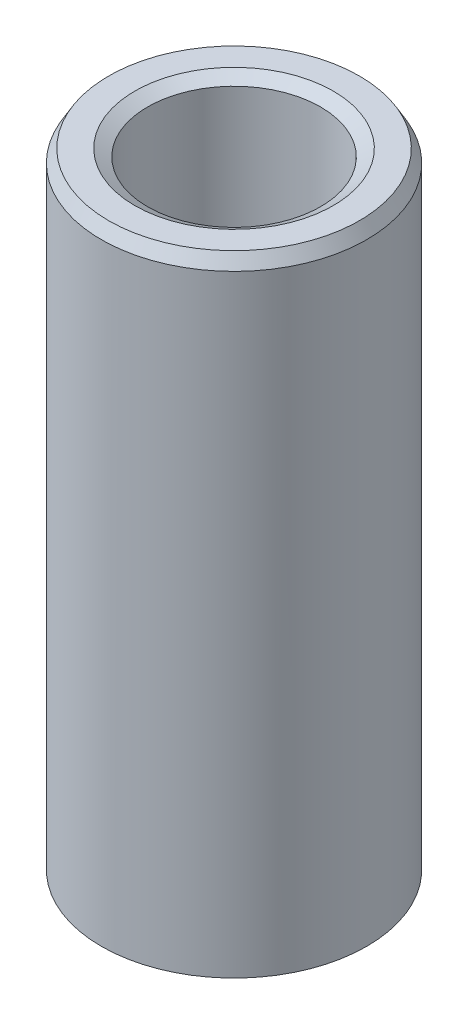
ISO-10303-21;
HEADER;
FILE_DESCRIPTION(('STEP AP214'),'2;1');
FILE_NAME('part.step','',(''),(''),'','','');
FILE_SCHEMA(('AUTOMOTIVE_DESIGN { 1 0 10303 214 1 1 1 1 }'));
ENDSEC;
DATA;
#1=APPLICATION_CONTEXT('core data for automotive mechanical design processes');
#2=APPLICATION_PROTOCOL_DEFINITION('international standard','automotive_design',2000,#1);
#3=PRODUCT_CONTEXT('',#1,'mechanical');
#4=PRODUCT('Part','Part','',(#3));
#5=PRODUCT_RELATED_PRODUCT_CATEGORY('part','',(#4));
#6=PRODUCT_DEFINITION_FORMATION('','',#4);
#7=PRODUCT_DEFINITION_CONTEXT('part definition',#1,'design');
#8=PRODUCT_DEFINITION('design','',#6,#7);
#9=PRODUCT_DEFINITION_SHAPE('','',#8);
#10=(LENGTH_UNIT() NAMED_UNIT(*) SI_UNIT(.MILLI.,.METRE.));
#11=(NAMED_UNIT(*) PLANE_ANGLE_UNIT() SI_UNIT($,.RADIAN.));
#12=(NAMED_UNIT(*) SI_UNIT($,.STERADIAN.) SOLID_ANGLE_UNIT());
#13=UNCERTAINTY_MEASURE_WITH_UNIT(LENGTH_MEASURE(1.E-05),#10,'distance_accuracy_value','');
#14=(GEOMETRIC_REPRESENTATION_CONTEXT(3) GLOBAL_UNCERTAINTY_ASSIGNED_CONTEXT((#13)) GLOBAL_UNIT_ASSIGNED_CONTEXT((#10,
#11,#12)) REPRESENTATION_CONTEXT('',''));
#15=CARTESIAN_POINT('',(0.,0.,0.));
#16=DIRECTION('',(0.,0.,1.));
#17=DIRECTION('',(1.,0.,0.));
#18=AXIS2_PLACEMENT_3D('',#15,#16,#17);
#19=CARTESIAN_POINT('',(0.,71.4394837840587,0.));
#20=DIRECTION('',(0.,-1.,0.));
#21=DIRECTION('',(0.,0.,-1.));
#22=AXIS2_PLACEMENT_3D('',#19,#20,#21);
#23=CYLINDRICAL_SURFACE('',#22,15.);
#24=CARTESIAN_POINT('',(0.,0.831120561861132,0.));
#25=DIRECTION('',(0.,1.,0.));
#26=DIRECTION('',(0.,0.,1.));
#27=AXIS2_PLACEMENT_3D('',#24,#25,#26);
#28=CIRCLE('',#27,15.);
#29=CARTESIAN_POINT('',(0.,0.831120561861118,-15.));
#30=VERTEX_POINT('',#29);
#31=EDGE_CURVE('E10',#30,#30,#28,.T.);
#32=CARTESIAN_POINT('',(0.,69.9999407437002,0.));
#33=DIRECTION('',(0.,1.,0.));
#34=DIRECTION('',(0.,0.,1.));
#35=AXIS2_PLACEMENT_3D('',#32,#33,#34);
#36=CIRCLE('',#35,15.);
#37=CARTESIAN_POINT('',(0.,69.9999407437002,-15.));
#38=VERTEX_POINT('',#37);
#39=EDGE_CURVE('E50',#38,#38,#36,.F.);
#40=CARTESIAN_POINT('',(0.,0.831120561861118,-15.));
#41=CARTESIAN_POINT('',(0.,1.55162910542194,-15.));
#42=CARTESIAN_POINT('',(0.,2.27213764898277,-15.));
#43=CARTESIAN_POINT('',(0.,3.71315473610441,-15.));
#44=CARTESIAN_POINT('',(0.,4.43366327966524,-15.));
#45=CARTESIAN_POINT('',(0.,5.87468036678688,-15.));
#46=CARTESIAN_POINT('',(0.,6.59518891034771,-15.));
#47=CARTESIAN_POINT('',(0.,8.03620599746935,-15.));
#48=CARTESIAN_POINT('',(0.,8.75671454103018,-15.));
#49=CARTESIAN_POINT('',(0.,10.1977316281518,-15.));
#50=CARTESIAN_POINT('',(0.,10.9182401717126,-15.));
#51=CARTESIAN_POINT('',(0.,12.3592572588343,-15.));
#52=CARTESIAN_POINT('',(0.,13.0797658023951,-15.));
#53=CARTESIAN_POINT('',(0.,14.5207828895168,-15.));
#54=CARTESIAN_POINT('',(0.,15.2412914330776,-15.));
#55=CARTESIAN_POINT('',(0.,16.6823085201992,-15.));
#56=CARTESIAN_POINT('',(0.,17.4028170637601,-15.));
#57=CARTESIAN_POINT('',(0.,18.8438341508817,-15.));
#58=CARTESIAN_POINT('',(0.,19.5643426944425,-15.));
#59=CARTESIAN_POINT('',(0.,21.0053597815642,-15.));
#60=CARTESIAN_POINT('',(0.,21.725868325125,-15.));
#61=CARTESIAN_POINT('',(0.,23.1668854122466,-15.));
#62=CARTESIAN_POINT('',(0.,23.8873939558075,-15.));
#63=CARTESIAN_POINT('',(0.,25.3284110429291,-15.));
#64=CARTESIAN_POINT('',(0.,26.0489195864899,-15.));
#65=CARTESIAN_POINT('',(0.,27.4899366736116,-15.));
#66=CARTESIAN_POINT('',(0.,28.2104452171724,-15.));
#67=CARTESIAN_POINT('',(0.,29.6514623042941,-15.));
#68=CARTESIAN_POINT('',(0.,30.3719708478549,-15.));
#69=CARTESIAN_POINT('',(0.,31.8129879349765,-15.));
#70=CARTESIAN_POINT('',(0.,32.5334964785374,-15.));
#71=CARTESIAN_POINT('',(0.,33.974513565659,-15.));
#72=CARTESIAN_POINT('',(0.,34.6950221092198,-15.));
#73=CARTESIAN_POINT('',(0.,36.1360391963415,-15.));
#74=CARTESIAN_POINT('',(0.,36.8565477399023,-15.));
#75=CARTESIAN_POINT('',(0.,38.2975648270239,-15.));
#76=CARTESIAN_POINT('',(0.,39.0180733705848,-15.));
#77=CARTESIAN_POINT('',(0.,40.4590904577064,-15.));
#78=CARTESIAN_POINT('',(0.,41.1795990012672,-15.));
#79=CARTESIAN_POINT('',(0.,42.6206160883889,-15.));
#80=CARTESIAN_POINT('',(0.,43.3411246319497,-15.));
#81=CARTESIAN_POINT('',(0.,44.7821417190714,-15.));
#82=CARTESIAN_POINT('',(0.,45.5026502626322,-15.));
#83=CARTESIAN_POINT('',(0.,46.9436673497538,-15.));
#84=CARTESIAN_POINT('',(0.,47.6641758933147,-15.));
#85=CARTESIAN_POINT('',(0.,49.1051929804363,-15.));
#86=CARTESIAN_POINT('',(0.,49.8257015239971,-15.));
#87=CARTESIAN_POINT('',(0.,51.2667186111188,-15.));
#88=CARTESIAN_POINT('',(0.,51.9872271546796,-15.));
#89=CARTESIAN_POINT('',(0.,53.4282442418013,-15.));
#90=CARTESIAN_POINT('',(0.,54.1487527853621,-15.));
#91=CARTESIAN_POINT('',(0.,55.5897698724837,-15.));
#92=CARTESIAN_POINT('',(0.,56.3102784160445,-15.));
#93=CARTESIAN_POINT('',(0.,57.7512955031662,-15.));
#94=CARTESIAN_POINT('',(0.,58.471804046727,-15.));
#95=CARTESIAN_POINT('',(0.,59.9128211338487,-15.));
#96=CARTESIAN_POINT('',(0.,60.6333296774095,-15.));
#97=CARTESIAN_POINT('',(0.,62.0743467645311,-15.));
#98=CARTESIAN_POINT('',(0.,62.794855308092,-15.));
#99=CARTESIAN_POINT('',(0.,64.2358723952136,-15.));
#100=CARTESIAN_POINT('',(0.,64.9563809387744,-15.));
#101=CARTESIAN_POINT('',(0.,66.3973980258961,-15.));
#102=CARTESIAN_POINT('',(0.,67.1179065694569,-15.));
#103=CARTESIAN_POINT('',(0.,68.5589236565785,-15.));
#104=CARTESIAN_POINT('',(0.,69.2794322001394,-15.));
#105=CARTESIAN_POINT('',(0.,69.9999407437002,-15.));
#106=B_SPLINE_CURVE_WITH_KNOTS('',3,(#40,#41,#42,#43,#44,#45,#46,#47,#48,#49,#50,#51,#52,#53,
#54,#55,#56,#57,#58,#59,#60,#61,#62,#63,#64,#65,#66,#67,#68,#69,#70,#71,#72,#73,#74,#75,#76,#77,
#78,#79,#80,#81,#82,#83,#84,#85,#86,#87,#88,#89,#90,#91,#92,#93,#94,#95,#96,#97,#98,#99,#100,
#101,#102,#103,#104,#105),.UNSPECIFIED.,.F.,.F.,(4,2,2,2,2,2,2,2,2,2,2,2,2,2,2,2,2,2,2,2,2,2,2,
2,2,2,2,2,2,2,2,2,4),(0.,2.16152563068248,4.32305126136494,6.48457689204741,8.64610252272988,
10.8076281534124,12.9691537840948,15.1306794147773,17.2922050454598,19.4537306761422,
21.6152563068247,23.7767819375072,25.9383075681896,28.0998331988721,30.2613588295546,
32.4228844602371,34.5844100909195,36.745935721602,38.9074613522845,41.0689869829669,
43.2305126136494,45.3920382443319,47.5535638750144,49.7150895056968,51.8766151363793,
54.0381407670618,56.1996663977443,58.3611920284267,60.5227176591092,62.6842432897917,
64.8457689204741,67.0072945511566,69.1688201818391),.UNSPECIFIED.);
#107=EDGE_CURVE('BSEAM39',#30,#38,#106,.T.);
#108=ORIENTED_EDGE('',*,*,#31,.T.);
#109=ORIENTED_EDGE('',*,*,#39,.T.);
#110=ORIENTED_EDGE('',*,*,#107,.T.);
#111=ORIENTED_EDGE('',*,*,#107,.F.);
#112=EDGE_LOOP('',(#108,#110,#109,#111));
#113=FACE_BOUND('',#112,.T.);
#114=ADVANCED_FACE('F39',(#113),#23,.T.);
#115=CARTESIAN_POINT('',(0.,71.4394837840587,0.));
#116=DIRECTION('',(0.,1.,0.));
#117=DIRECTION('',(0.,0.,1.));
#118=AXIS2_PLACEMENT_3D('',#115,#116,#117);
#119=PLANE('',#118);
#120=CARTESIAN_POINT('',(0.,71.4394837840587,0.));
#121=DIRECTION('',(0.,1.,0.));
#122=DIRECTION('',(0.,0.,1.));
#123=AXIS2_PLACEMENT_3D('',#120,#121,#122);
#124=CIRCLE('',#123,11.2150899528839);
#125=CARTESIAN_POINT('',(0.,71.4394837840587,11.2150899528839));
#126=VERTEX_POINT('',#125);
#127=EDGE_CURVE('E58',#126,#126,#124,.F.);
#128=ORIENTED_EDGE('',*,*,#127,.T.);
#129=EDGE_LOOP('',(#128));
#130=FACE_BOUND('',#129,.T.);
#131=CARTESIAN_POINT('',(0.,71.4394837840587,0.));
#132=DIRECTION('',(0.,1.,0.));
#133=DIRECTION('',(0.,0.,1.));
#134=AXIS2_PLACEMENT_3D('',#131,#132,#133);
#135=CIRCLE('',#134,14.168879438139);
#136=CARTESIAN_POINT('',(0.,71.4394837840587,14.168879438139));
#137=VERTEX_POINT('',#136);
#138=EDGE_CURVE('E61',#137,#137,#135,.T.);
#139=ORIENTED_EDGE('',*,*,#138,.T.);
#140=EDGE_LOOP('',(#139));
#141=FACE_BOUND('',#140,.T.);
#142=ADVANCED_FACE('F88',(#130,#141),#119,.T.);
#143=CARTESIAN_POINT('',(0.,0.,0.));
#144=DIRECTION('',(0.,1.,0.));
#145=DIRECTION('',(0.,0.,1.));
#146=AXIS2_PLACEMENT_3D('',#143,#144,#145);
#147=PLANE('',#146);
#148=CARTESIAN_POINT('',(0.,0.,0.));
#149=DIRECTION('',(0.,1.,0.));
#150=DIRECTION('',(0.,0.,1.));
#151=AXIS2_PLACEMENT_3D('',#148,#149,#150);
#152=CIRCLE('',#151,10.6066674743864);
#153=CARTESIAN_POINT('',(0.,0.,10.6066674743864));
#154=VERTEX_POINT('',#153);
#155=EDGE_CURVE('E51',#154,#154,#152,.T.);
#156=ORIENTED_EDGE('',*,*,#155,.T.);
#157=EDGE_LOOP('',(#156));
#158=FACE_BOUND('',#157,.T.);
#159=CARTESIAN_POINT('',(0.,0.,0.));
#160=DIRECTION('',(0.,1.,0.));
#161=DIRECTION('',(0.,0.,1.));
#162=AXIS2_PLACEMENT_3D('',#159,#160,#161);
#163=CIRCLE('',#162,13.5604569596413);
#164=CARTESIAN_POINT('',(0.,0.,13.5604569596413));
#165=VERTEX_POINT('',#164);
#166=EDGE_CURVE('E54',#165,#165,#163,.F.);
#167=ORIENTED_EDGE('',*,*,#166,.T.);
#168=EDGE_LOOP('',(#167));
#169=FACE_BOUND('',#168,.T.);
#170=ADVANCED_FACE('F83',(#158,#169),#147,.F.);
#171=CARTESIAN_POINT('',(0.,71.4394837840587,0.));
#172=DIRECTION('',(0.,-1.,0.));
#173=DIRECTION('',(0.,0.,-1.));
#174=AXIS2_PLACEMENT_3D('',#171,#172,#173);
#175=CYLINDRICAL_SURFACE('',#174,9.77554691252529);
#176=CARTESIAN_POINT('',(0.,70.6083632221976,0.));
#177=DIRECTION('',(0.,1.,0.));
#178=DIRECTION('',(0.,0.,1.));
#179=AXIS2_PLACEMENT_3D('',#176,#177,#178);
#180=CIRCLE('',#179,9.77554691252529);
#181=CARTESIAN_POINT('',(0.,70.6083632221976,-9.77554691252529));
#182=VERTEX_POINT('',#181);
#183=EDGE_CURVE('E67',#182,#182,#180,.T.);
#184=CARTESIAN_POINT('',(0.,1.43954304035862,0.));
#185=DIRECTION('',(0.,1.,0.));
#186=DIRECTION('',(0.,0.,1.));
#187=AXIS2_PLACEMENT_3D('',#184,#185,#186);
#188=CIRCLE('',#187,9.77554691252529);
#189=CARTESIAN_POINT('',(0.,1.43954304035861,-9.77554691252529));
#190=VERTEX_POINT('',#189);
#191=EDGE_CURVE('E69',#190,#190,#188,.F.);
#192=CARTESIAN_POINT('',(0.,70.6083632221976,-9.77554691252529));
#193=CARTESIAN_POINT('',(0.,69.8878546786368,-9.77554691252529));
#194=CARTESIAN_POINT('',(0.,69.167346135076,-9.77554691252529));
#195=CARTESIAN_POINT('',(0.,67.7263290479543,-9.77554691252529));
#196=CARTESIAN_POINT('',(0.,67.0058205043935,-9.77554691252529));
#197=CARTESIAN_POINT('',(0.,65.5648034172718,-9.77554691252529));
#198=CARTESIAN_POINT('',(0.,64.844294873711,-9.77554691252529));
#199=CARTESIAN_POINT('',(0.,63.4032777865894,-9.77554691252529));
#200=CARTESIAN_POINT('',(0.,62.6827692430286,-9.77554691252529));
#201=CARTESIAN_POINT('',(0.,61.2417521559069,-9.77554691252529));
#202=CARTESIAN_POINT('',(0.,60.5212436123461,-9.77554691252529));
#203=CARTESIAN_POINT('',(0.,59.0802265252244,-9.77554691252529));
#204=CARTESIAN_POINT('',(0.,58.3597179816636,-9.77554691252529));
#205=CARTESIAN_POINT('',(0.,56.918700894542,-9.77554691252529));
#206=CARTESIAN_POINT('',(0.,56.1981923509811,-9.77554691252529));
#207=CARTESIAN_POINT('',(0.,54.7571752638595,-9.77554691252529));
#208=CARTESIAN_POINT('',(0.,54.0366667202987,-9.77554691252529));
#209=CARTESIAN_POINT('',(0.,52.595649633177,-9.77554691252529));
#210=CARTESIAN_POINT('',(0.,51.8751410896162,-9.77554691252529));
#211=CARTESIAN_POINT('',(0.,50.4341240024946,-9.77554691252529));
#212=CARTESIAN_POINT('',(0.,49.7136154589337,-9.77554691252529));
#213=CARTESIAN_POINT('',(0.,48.2725983718121,-9.77554691252529));
#214=CARTESIAN_POINT('',(0.,47.5520898282513,-9.77554691252529));
#215=CARTESIAN_POINT('',(0.,46.1110727411296,-9.77554691252529));
#216=CARTESIAN_POINT('',(0.,45.3905641975688,-9.77554691252529));
#217=CARTESIAN_POINT('',(0.,43.9495471104472,-9.77554691252529));
#218=CARTESIAN_POINT('',(0.,43.2290385668863,-9.77554691252529));
#219=CARTESIAN_POINT('',(0.,41.7880214797647,-9.77554691252529));
#220=CARTESIAN_POINT('',(0.,41.0675129362039,-9.77554691252529));
#221=CARTESIAN_POINT('',(0.,39.6264958490822,-9.77554691252529));
#222=CARTESIAN_POINT('',(0.,38.9059873055214,-9.77554691252529));
#223=CARTESIAN_POINT('',(0.,37.4649702183998,-9.77554691252529));
#224=CARTESIAN_POINT('',(0.,36.7444616748389,-9.77554691252529));
#225=CARTESIAN_POINT('',(0.,35.3034445877173,-9.77554691252529));
#226=CARTESIAN_POINT('',(0.,34.5829360441565,-9.77554691252529));
#227=CARTESIAN_POINT('',(0.,33.1419189570348,-9.77554691252529));
#228=CARTESIAN_POINT('',(0.,32.421410413474,-9.77554691252529));
#229=CARTESIAN_POINT('',(0.,30.9803933263523,-9.77554691252529));
#230=CARTESIAN_POINT('',(0.,30.2598847827915,-9.77554691252529));
#231=CARTESIAN_POINT('',(0.,28.8188676956699,-9.77554691252529));
#232=CARTESIAN_POINT('',(0.,28.0983591521091,-9.77554691252529));
#233=CARTESIAN_POINT('',(0.,26.6573420649874,-9.77554691252529));
#234=CARTESIAN_POINT('',(0.,25.9368335214266,-9.77554691252529));
#235=CARTESIAN_POINT('',(0.,24.4958164343049,-9.77554691252529));
#236=CARTESIAN_POINT('',(0.,23.7753078907441,-9.77554691252529));
#237=CARTESIAN_POINT('',(0.,22.3342908036225,-9.77554691252529));
#238=CARTESIAN_POINT('',(0.,21.6137822600617,-9.77554691252529));
#239=CARTESIAN_POINT('',(0.,20.17276517294,-9.77554691252529));
#240=CARTESIAN_POINT('',(0.,19.4522566293792,-9.77554691252529));
#241=CARTESIAN_POINT('',(0.,18.0112395422575,-9.77554691252529));
#242=CARTESIAN_POINT('',(0.,17.2907309986967,-9.77554691252529));
#243=CARTESIAN_POINT('',(0.,15.8497139115751,-9.77554691252529));
#244=CARTESIAN_POINT('',(0.,15.1292053680142,-9.77554691252529));
#245=CARTESIAN_POINT('',(0.,13.6881882808926,-9.77554691252529));
#246=CARTESIAN_POINT('',(0.,12.9676797373318,-9.77554691252529));
#247=CARTESIAN_POINT('',(0.,11.5266626502101,-9.77554691252529));
#248=CARTESIAN_POINT('',(0.,10.8061541066493,-9.77554691252529));
#249=CARTESIAN_POINT('',(0.,9.36513701952766,-9.77554691252529));
#250=CARTESIAN_POINT('',(0.,8.64462847596683,-9.77554691252529));
#251=CARTESIAN_POINT('',(0.,7.20361138884519,-9.77554691252529));
#252=CARTESIAN_POINT('',(0.,6.48310284528437,-9.77554691252529));
#253=CARTESIAN_POINT('',(0.,5.04208575816273,-9.77554691252529));
#254=CARTESIAN_POINT('',(0.,4.32157721460191,-9.77554691252529));
#255=CARTESIAN_POINT('',(0.,2.88056012748026,-9.77554691252529));
#256=CARTESIAN_POINT('',(0.,2.16005158391943,-9.77554691252529));
#257=CARTESIAN_POINT('',(0.,1.43954304035861,-9.77554691252529));
#258=B_SPLINE_CURVE_WITH_KNOTS('',3,(#192,#193,#194,#195,#196,#197,#198,#199,#200,#201,#202,
#203,#204,#205,#206,#207,#208,#209,#210,#211,#212,#213,#214,#215,#216,#217,#218,#219,#220,#221,
#222,#223,#224,#225,#226,#227,#228,#229,#230,#231,#232,#233,#234,#235,#236,#237,#238,#239,#240,
#241,#242,#243,#244,#245,#246,#247,#248,#249,#250,#251,#252,#253,#254,#255,#256,#257),
.UNSPECIFIED.,.F.,.F.,(4,2,2,2,2,2,2,2,2,2,2,2,2,2,2,2,2,2,2,2,2,2,2,2,2,2,2,2,2,2,2,2,4),(0.,
2.16152563068248,4.32305126136494,6.48457689204741,8.64610252272988,10.8076281534124,
12.9691537840948,15.1306794147773,17.2922050454598,19.4537306761422,21.6152563068247,
23.7767819375072,25.9383075681896,28.0998331988721,30.2613588295546,32.422884460237,
34.5844100909195,36.745935721602,38.9074613522844,41.0689869829669,43.2305126136494,
45.3920382443319,47.5535638750143,49.7150895056968,51.8766151363793,54.0381407670617,
56.1996663977442,58.3611920284267,60.5227176591091,62.6842432897916,64.8457689204741,
67.0072945511565,69.168820181839),.UNSPECIFIED.);
#259=EDGE_CURVE('BSEAM71',#182,#190,#258,.T.);
#260=ORIENTED_EDGE('',*,*,#183,.T.);
#261=ORIENTED_EDGE('',*,*,#191,.T.);
#262=ORIENTED_EDGE('',*,*,#259,.T.);
#263=ORIENTED_EDGE('',*,*,#259,.F.);
#264=EDGE_LOOP('',(#260,#262,#261,#263));
#265=FACE_BOUND('',#264,.T.);
#266=ADVANCED_FACE('F71',(#265),#175,.F.);
#267=CARTESIAN_POINT('',(0.,70.6083632221976,0.));
#268=DIRECTION('',(0.,1.,0.));
#269=DIRECTION('',(0.,0.,1.));
#270=AXIS2_PLACEMENT_3D('',#267,#268,#269);
#271=CONICAL_SURFACE('',#270,9.77554691252529,1.0471975511966);
#272=ORIENTED_EDGE('',*,*,#127,.F.);
#273=EDGE_LOOP('',(#272));
#274=FACE_BOUND('',#273,.T.);
#275=ORIENTED_EDGE('',*,*,#183,.F.);
#276=EDGE_LOOP('',(#275));
#277=FACE_BOUND('',#276,.T.);
#278=ADVANCED_FACE('F77',(#274,#277),#271,.F.);
#279=CARTESIAN_POINT('',(0.,0.,0.));
#280=DIRECTION('',(0.,-1.,0.));
#281=DIRECTION('',(0.,0.,-1.));
#282=AXIS2_PLACEMENT_3D('',#279,#280,#281);
#283=CONICAL_SURFACE('',#282,10.6066674743864,0.523598775598293);
#284=ORIENTED_EDGE('',*,*,#191,.F.);
#285=EDGE_LOOP('',(#284));
#286=FACE_BOUND('',#285,.T.);
#287=ORIENTED_EDGE('',*,*,#155,.F.);
#288=EDGE_LOOP('',(#287));
#289=FACE_BOUND('',#288,.T.);
#290=ADVANCED_FACE('F73',(#286,#289),#283,.F.);
#291=CARTESIAN_POINT('',(0.,0.831120561861132,0.));
#292=DIRECTION('',(0.,1.,0.));
#293=DIRECTION('',(0.,0.,1.));
#294=AXIS2_PLACEMENT_3D('',#291,#292,#293);
#295=CONICAL_SURFACE('',#294,15.,1.0471975511966);
#296=ORIENTED_EDGE('',*,*,#166,.F.);
#297=EDGE_LOOP('',(#296));
#298=FACE_BOUND('',#297,.T.);
#299=ORIENTED_EDGE('',*,*,#31,.F.);
#300=EDGE_LOOP('',(#299));
#301=FACE_BOUND('',#300,.T.);
#302=ADVANCED_FACE('F76',(#298,#301),#295,.T.);
#303=CARTESIAN_POINT('',(0.,71.4394837840587,0.));
#304=DIRECTION('',(0.,-1.,0.));
#305=DIRECTION('',(0.,0.,-1.));
#306=AXIS2_PLACEMENT_3D('',#303,#304,#305);
#307=CONICAL_SURFACE('',#306,14.168879438139,0.523598775598297);
#308=ORIENTED_EDGE('',*,*,#39,.F.);
#309=EDGE_LOOP('',(#308));
#310=FACE_BOUND('',#309,.T.);
#311=ORIENTED_EDGE('',*,*,#138,.F.);
#312=EDGE_LOOP('',(#311));
#313=FACE_BOUND('',#312,.T.);
#314=ADVANCED_FACE('F45',(#310,#313),#307,.T.);
#315=CLOSED_SHELL('',(#114,#142,#170,#266,#278,#290,#302,#314));
#316=MANIFOLD_SOLID_BREP('B2',#315);
#317=ADVANCED_BREP_SHAPE_REPRESENTATION('',(#18,#316),#14);
#318=SHAPE_DEFINITION_REPRESENTATION(#9,#317);
ENDSEC;
END-ISO-10303-21;
